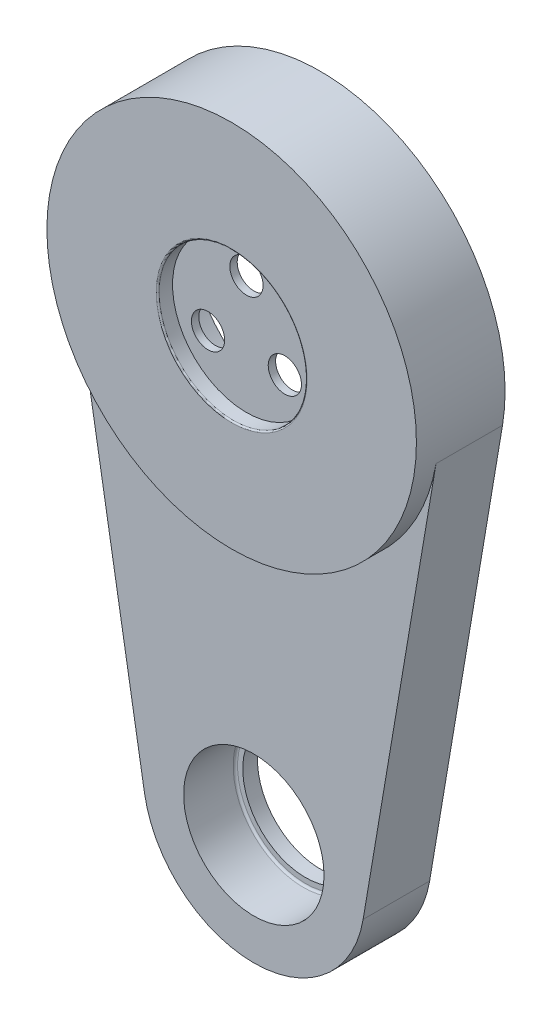
ISO-10303-21;
HEADER;
FILE_DESCRIPTION(('STEP AP214'),'2;1');
FILE_NAME('part.step','',(''),(''),'','','');
FILE_SCHEMA(('AUTOMOTIVE_DESIGN { 1 0 10303 214 1 1 1 1 }'));
ENDSEC;
DATA;
#1=APPLICATION_CONTEXT('core data for automotive mechanical design processes');
#2=APPLICATION_PROTOCOL_DEFINITION('international standard','automotive_design',2000,#1);
#3=PRODUCT_CONTEXT('',#1,'mechanical');
#4=PRODUCT('Part','Part','',(#3));
#5=PRODUCT_RELATED_PRODUCT_CATEGORY('part','',(#4));
#6=PRODUCT_DEFINITION_FORMATION('','',#4);
#7=PRODUCT_DEFINITION_CONTEXT('part definition',#1,'design');
#8=PRODUCT_DEFINITION('design','',#6,#7);
#9=PRODUCT_DEFINITION_SHAPE('','',#8);
#10=(LENGTH_UNIT() NAMED_UNIT(*) SI_UNIT(.MILLI.,.METRE.));
#11=(NAMED_UNIT(*) PLANE_ANGLE_UNIT() SI_UNIT($,.RADIAN.));
#12=(NAMED_UNIT(*) SI_UNIT($,.STERADIAN.) SOLID_ANGLE_UNIT());
#13=UNCERTAINTY_MEASURE_WITH_UNIT(LENGTH_MEASURE(1.E-05),#10,'distance_accuracy_value','');
#14=(GEOMETRIC_REPRESENTATION_CONTEXT(3) GLOBAL_UNCERTAINTY_ASSIGNED_CONTEXT((#13)) GLOBAL_UNIT_ASSIGNED_CONTEXT((#10,
#11,#12)) REPRESENTATION_CONTEXT('',''));
#15=CARTESIAN_POINT('',(0.,0.,0.));
#16=DIRECTION('',(0.,0.,1.));
#17=DIRECTION('',(1.,0.,0.));
#18=AXIS2_PLACEMENT_3D('',#15,#16,#17);
#19=CARTESIAN_POINT('',(0.,0.,-4.));
#20=DIRECTION('',(0.,0.,-1.));
#21=DIRECTION('',(-1.,0.,0.));
#22=AXIS2_PLACEMENT_3D('',#19,#20,#21);
#23=PLANE('',#22);
#24=CARTESIAN_POINT('',(0.,6.,-4.));
#25=DIRECTION('',(0.,0.,-1.));
#26=DIRECTION('',(-1.,0.,0.));
#27=AXIS2_PLACEMENT_3D('',#24,#25,#26);
#28=CIRCLE('',#27,3.99999999999999);
#29=CARTESIAN_POINT('',(-3.99999999999999,6.,-4.));
#30=VERTEX_POINT('',#29);
#31=EDGE_CURVE('E137',#30,#30,#28,.T.);
#32=ORIENTED_EDGE('',*,*,#31,.F.);
#33=EDGE_LOOP('',(#32));
#34=FACE_BOUND('',#33,.T.);
#35=CARTESIAN_POINT('',(-5.19615242270662,-3.00000000000003,-4.));
#36=DIRECTION('',(0.,0.,-1.));
#37=DIRECTION('',(-1.,0.,0.));
#38=AXIS2_PLACEMENT_3D('',#35,#36,#37);
#39=CIRCLE('',#38,3.99999999999999);
#40=CARTESIAN_POINT('',(-9.19615242270661,-3.00000000000003,-4.));
#41=VERTEX_POINT('',#40);
#42=EDGE_CURVE('E127',#41,#41,#39,.T.);
#43=ORIENTED_EDGE('',*,*,#42,.F.);
#44=EDGE_LOOP('',(#43));
#45=FACE_BOUND('',#44,.T.);
#46=CARTESIAN_POINT('',(5.19615242270666,-2.99999999999995,-4.));
#47=DIRECTION('',(0.,0.,-1.));
#48=DIRECTION('',(-1.,0.,0.));
#49=AXIS2_PLACEMENT_3D('',#46,#47,#48);
#50=CIRCLE('',#49,3.99999999999999);
#51=CARTESIAN_POINT('',(1.19615242270667,-2.99999999999995,-4.));
#52=VERTEX_POINT('',#51);
#53=EDGE_CURVE('E117',#52,#52,#50,.T.);
#54=ORIENTED_EDGE('',*,*,#53,.F.);
#55=EDGE_LOOP('',(#54));
#56=FACE_BOUND('',#55,.T.);
#57=CARTESIAN_POINT('',(0.,0.,-4.));
#58=DIRECTION('',(0.,0.,-1.));
#59=DIRECTION('',(-1.,0.,0.));
#60=AXIS2_PLACEMENT_3D('',#57,#58,#59);
#61=CIRCLE('',#60,17.5);
#62=CARTESIAN_POINT('',(-17.5,0.,-4.));
#63=VERTEX_POINT('',#62);
#64=EDGE_CURVE('E164',#63,#63,#61,.F.);
#65=ORIENTED_EDGE('',*,*,#64,.F.);
#66=EDGE_LOOP('',(#65));
#67=FACE_BOUND('',#66,.T.);
#68=ADVANCED_FACE('F38',(#34,#45,#56,#67),#23,.T.);
#69=CARTESIAN_POINT('',(0.,0.,-2.));
#70=DIRECTION('',(0.,0.,1.));
#71=DIRECTION('',(1.,0.,0.));
#72=AXIS2_PLACEMENT_3D('',#69,#70,#71);
#73=CYLINDRICAL_SURFACE('',#72,25.);
#74=CARTESIAN_POINT('',(0.,0.,0.));
#75=DIRECTION('',(0.,0.,-1.));
#76=DIRECTION('',(-1.,0.,0.));
#77=AXIS2_PLACEMENT_3D('',#74,#75,#76);
#78=CIRCLE('',#77,25.);
#79=CARTESIAN_POINT('',(-25.,0.,0.));
#80=VERTEX_POINT('',#79);
#81=EDGE_CURVE('E155',#80,#80,#78,.T.);
#82=ORIENTED_EDGE('',*,*,#81,.T.);
#83=EDGE_LOOP('',(#82));
#84=FACE_BOUND('',#83,.T.);
#85=CARTESIAN_POINT('',(0.,0.,-12.));
#86=DIRECTION('',(0.,0.,-1.));
#87=DIRECTION('',(-1.,0.,0.));
#88=AXIS2_PLACEMENT_3D('',#85,#86,#87);
#89=CIRCLE('',#88,25.);
#90=CARTESIAN_POINT('',(-24.6503324295817,-4.16666666666667,-12.));
#91=VERTEX_POINT('',#90);
#92=CARTESIAN_POINT('',(24.6503324295817,-4.16666666666667,-12.));
#93=VERTEX_POINT('',#92);
#94=EDGE_CURVE('E150',#91,#93,#89,.T.);
#95=ORIENTED_EDGE('',*,*,#94,.F.);
#96=DIRECTION('',(0.,0.,-1.));
#97=VECTOR('',#96,1.);
#98=CARTESIAN_POINT('',(-24.6503324295817,-4.16666666666667,-3.));
#99=LINE('',#98,#97);
#100=CARTESIAN_POINT('',(-24.6503324295817,-4.16666666666667,-3.));
#101=VERTEX_POINT('',#100);
#102=EDGE_CURVE('E110',#101,#91,#99,.T.);
#103=ORIENTED_EDGE('',*,*,#102,.F.);
#104=CARTESIAN_POINT('',(0.,0.,-3.));
#105=DIRECTION('',(0.,0.,1.));
#106=DIRECTION('',(-1.,0.,0.));
#107=AXIS2_PLACEMENT_3D('',#104,#105,#106);
#108=CIRCLE('',#107,25.);
#109=CARTESIAN_POINT('',(24.6503324295817,-4.16666666666667,-3.));
#110=VERTEX_POINT('',#109);
#111=EDGE_CURVE('E62',#101,#110,#108,.T.);
#112=ORIENTED_EDGE('',*,*,#111,.T.);
#113=DIRECTION('',(0.,0.,-1.));
#114=VECTOR('',#113,1.);
#115=CARTESIAN_POINT('',(24.6503324295817,-4.16666666666667,-3.));
#116=LINE('',#115,#114);
#117=EDGE_CURVE('E86',#110,#93,#116,.T.);
#118=ORIENTED_EDGE('',*,*,#117,.T.);
#119=EDGE_LOOP('',(#95,#103,#112,#118));
#120=FACE_BOUND('',#119,.T.);
#121=ADVANCED_FACE('F194',(#84,#120),#73,.T.);
#122=CARTESIAN_POINT('',(0.,0.,0.));
#123=DIRECTION('',(0.,0.,-1.));
#124=DIRECTION('',(-1.,0.,0.));
#125=AXIS2_PLACEMENT_3D('',#122,#123,#124);
#126=PLANE('',#125);
#127=CARTESIAN_POINT('',(0.,0.,0.));
#128=DIRECTION('',(0.,0.,-1.));
#129=DIRECTION('',(-1.,0.,0.));
#130=AXIS2_PLACEMENT_3D('',#127,#128,#129);
#131=CIRCLE('',#130,10.2);
#132=CARTESIAN_POINT('',(-10.2,0.,0.));
#133=VERTEX_POINT('',#132);
#134=EDGE_CURVE('E161',#133,#133,#131,.T.);
#135=ORIENTED_EDGE('',*,*,#134,.T.);
#136=EDGE_LOOP('',(#135));
#137=FACE_BOUND('',#136,.T.);
#138=ORIENTED_EDGE('',*,*,#81,.F.);
#139=EDGE_LOOP('',(#138));
#140=FACE_BOUND('',#139,.T.);
#141=ADVANCED_FACE('F200',(#137,#140),#126,.F.);
#142=CARTESIAN_POINT('',(0.,0.,-2.));
#143=DIRECTION('',(0.,0.,1.));
#144=DIRECTION('',(1.,0.,0.));
#145=AXIS2_PLACEMENT_3D('',#142,#143,#144);
#146=CYLINDRICAL_SURFACE('',#145,10.);
#147=CARTESIAN_POINT('',(0.,0.,-0.2));
#148=DIRECTION('',(0.,0.,-1.));
#149=DIRECTION('',(-1.,0.,0.));
#150=AXIS2_PLACEMENT_3D('',#147,#148,#149);
#151=CIRCLE('',#150,10.);
#152=CARTESIAN_POINT('',(-10.,0.,-0.2));
#153=VERTEX_POINT('',#152);
#154=EDGE_CURVE('E158',#153,#153,#151,.F.);
#155=ORIENTED_EDGE('',*,*,#154,.T.);
#156=EDGE_LOOP('',(#155));
#157=FACE_BOUND('',#156,.T.);
#158=CARTESIAN_POINT('',(0.,0.,-2.));
#159=DIRECTION('',(0.,0.,1.));
#160=DIRECTION('',(1.,0.,0.));
#161=AXIS2_PLACEMENT_3D('',#158,#159,#160);
#162=CIRCLE('',#161,10.);
#163=CARTESIAN_POINT('',(10.,0.,-2.));
#164=VERTEX_POINT('',#163);
#165=EDGE_CURVE('E152',#164,#164,#162,.T.);
#166=ORIENTED_EDGE('',*,*,#165,.F.);
#167=EDGE_LOOP('',(#166));
#168=FACE_BOUND('',#167,.T.);
#169=ADVANCED_FACE('F222',(#157,#168),#146,.F.);
#170=CARTESIAN_POINT('',(0.,0.,-0.2));
#171=DIRECTION('',(0.,0.,-1.));
#172=DIRECTION('',(-1.,0.,0.));
#173=AXIS2_PLACEMENT_3D('',#170,#171,#172);
#174=TOROIDAL_SURFACE('',#173,10.2,0.2);
#175=ORIENTED_EDGE('',*,*,#134,.F.);
#176=EDGE_LOOP('',(#175));
#177=FACE_BOUND('',#176,.T.);
#178=ORIENTED_EDGE('',*,*,#154,.F.);
#179=EDGE_LOOP('',(#178));
#180=FACE_BOUND('',#179,.T.);
#181=ADVANCED_FACE('F220',(#177,#180),#174,.T.);
#182=CARTESIAN_POINT('',(0.,0.,-2.));
#183=DIRECTION('',(0.,0.,-1.));
#184=DIRECTION('',(-1.,0.,0.));
#185=AXIS2_PLACEMENT_3D('',#182,#183,#184);
#186=PLANE('',#185);
#187=CARTESIAN_POINT('',(5.19615242270666,-2.99999999999995,-2.));
#188=DIRECTION('',(0.,0.,-1.));
#189=DIRECTION('',(-1.,0.,0.));
#190=AXIS2_PLACEMENT_3D('',#187,#188,#189);
#191=CIRCLE('',#190,2.25);
#192=CARTESIAN_POINT('',(2.94615242270666,-2.99999999999995,-2.));
#193=VERTEX_POINT('',#192);
#194=EDGE_CURVE('E126',#193,#193,#191,.T.);
#195=ORIENTED_EDGE('',*,*,#194,.T.);
#196=EDGE_LOOP('',(#195));
#197=FACE_BOUND('',#196,.T.);
#198=CARTESIAN_POINT('',(-5.19615242270662,-3.00000000000003,-2.));
#199=DIRECTION('',(0.,0.,-1.));
#200=DIRECTION('',(-1.,0.,0.));
#201=AXIS2_PLACEMENT_3D('',#198,#199,#200);
#202=CIRCLE('',#201,2.25);
#203=CARTESIAN_POINT('',(-7.44615242270662,-3.00000000000003,-2.));
#204=VERTEX_POINT('',#203);
#205=EDGE_CURVE('E136',#204,#204,#202,.T.);
#206=ORIENTED_EDGE('',*,*,#205,.T.);
#207=EDGE_LOOP('',(#206));
#208=FACE_BOUND('',#207,.T.);
#209=CARTESIAN_POINT('',(0.,6.,-2.));
#210=DIRECTION('',(0.,0.,-1.));
#211=DIRECTION('',(-1.,0.,0.));
#212=AXIS2_PLACEMENT_3D('',#209,#210,#211);
#213=CIRCLE('',#212,2.25);
#214=CARTESIAN_POINT('',(-2.25,6.,-2.));
#215=VERTEX_POINT('',#214);
#216=EDGE_CURVE('E146',#215,#215,#213,.T.);
#217=ORIENTED_EDGE('',*,*,#216,.T.);
#218=EDGE_LOOP('',(#217));
#219=FACE_BOUND('',#218,.T.);
#220=ORIENTED_EDGE('',*,*,#165,.T.);
#221=EDGE_LOOP('',(#220));
#222=FACE_BOUND('',#221,.T.);
#223=ADVANCED_FACE('F216',(#197,#208,#219,#222),#186,.F.);
#224=CARTESIAN_POINT('',(0.,0.,-12.));
#225=DIRECTION('',(0.,0.,-1.));
#226=DIRECTION('',(-1.,0.,0.));
#227=AXIS2_PLACEMENT_3D('',#224,#225,#226);
#228=PLANE('',#227);
#229=CARTESIAN_POINT('',(0.,-60.,-12.));
#230=DIRECTION('',(0.,0.,1.));
#231=DIRECTION('',(1.,0.,0.));
#232=AXIS2_PLACEMENT_3D('',#229,#230,#231);
#233=CIRCLE('',#232,8.50000000000001);
#234=CARTESIAN_POINT('',(8.5,-60.,-12.));
#235=VERTEX_POINT('',#234);
#236=EDGE_CURVE('E523',#235,#235,#233,.T.);
#237=ORIENTED_EDGE('',*,*,#236,.T.);
#238=EDGE_LOOP('',(#237));
#239=FACE_BOUND('',#238,.T.);
#240=CARTESIAN_POINT('',(0.,0.,-12.));
#241=DIRECTION('',(0.,0.,-1.));
#242=DIRECTION('',(-1.,0.,0.));
#243=AXIS2_PLACEMENT_3D('',#240,#241,#242);
#244=CIRCLE('',#243,18.5);
#245=CARTESIAN_POINT('',(-18.5,0.,-12.));
#246=VERTEX_POINT('',#245);
#247=EDGE_CURVE('E147',#246,#246,#244,.T.);
#248=ORIENTED_EDGE('',*,*,#247,.F.);
#249=EDGE_LOOP('',(#248));
#250=FACE_BOUND('',#249,.T.);
#251=ORIENTED_EDGE('',*,*,#94,.T.);
#252=DIRECTION('',(-0.166666666666667,-0.986013297183269,0.));
#253=VECTOR('',#252,1.);
#254=CARTESIAN_POINT('',(24.6503324295817,-4.16666666666667,-12.));
#255=LINE('',#254,#253);
#256=CARTESIAN_POINT('',(14.790199457749,-62.5,-12.));
#257=VERTEX_POINT('',#256);
#258=EDGE_CURVE('E105',#93,#257,#255,.T.);
#259=ORIENTED_EDGE('',*,*,#258,.T.);
#260=CARTESIAN_POINT('',(0.,-60.,-12.));
#261=DIRECTION('',(0.,0.,-1.));
#262=DIRECTION('',(-1.,0.,0.));
#263=AXIS2_PLACEMENT_3D('',#260,#261,#262);
#264=CIRCLE('',#263,15.);
#265=CARTESIAN_POINT('',(-14.790199457749,-62.5,-12.));
#266=VERTEX_POINT('',#265);
#267=EDGE_CURVE('E92',#257,#266,#264,.T.);
#268=ORIENTED_EDGE('',*,*,#267,.T.);
#269=DIRECTION('',(-0.166666666666667,0.986013297183269,0.));
#270=VECTOR('',#269,1.);
#271=CARTESIAN_POINT('',(-24.6503324295817,-4.16666666666667,-12.));
#272=LINE('',#271,#270);
#273=EDGE_CURVE('E53',#266,#91,#272,.T.);
#274=ORIENTED_EDGE('',*,*,#273,.T.);
#275=EDGE_LOOP('',(#251,#259,#268,#274));
#276=FACE_BOUND('',#275,.T.);
#277=ADVANCED_FACE('F212',(#239,#250,#276),#228,.T.);
#278=CARTESIAN_POINT('',(0.,0.,-4.));
#279=DIRECTION('',(0.,0.,-1.));
#280=DIRECTION('',(-1.,0.,0.));
#281=AXIS2_PLACEMENT_3D('',#278,#279,#280);
#282=CYLINDRICAL_SURFACE('',#281,18.5);
#283=CARTESIAN_POINT('',(0.,0.,-5.3));
#284=DIRECTION('',(0.,0.,-1.));
#285=DIRECTION('',(-1.,0.,0.));
#286=AXIS2_PLACEMENT_3D('',#283,#284,#285);
#287=CIRCLE('',#286,18.5);
#288=CARTESIAN_POINT('',(-18.5,0.,-5.3));
#289=VERTEX_POINT('',#288);
#290=EDGE_CURVE('E176',#289,#289,#287,.F.);
#291=ORIENTED_EDGE('',*,*,#290,.T.);
#292=EDGE_LOOP('',(#291));
#293=FACE_BOUND('',#292,.T.);
#294=ORIENTED_EDGE('',*,*,#247,.T.);
#295=EDGE_LOOP('',(#294));
#296=FACE_BOUND('',#295,.T.);
#297=ADVANCED_FACE('F209',(#293,#296),#282,.F.);
#298=CARTESIAN_POINT('',(0.,6.,-4.));
#299=DIRECTION('',(0.,0.,-1.));
#300=DIRECTION('',(-1.,0.,0.));
#301=AXIS2_PLACEMENT_3D('',#298,#299,#300);
#302=CYLINDRICAL_SURFACE('',#301,2.25);
#303=CARTESIAN_POINT('',(0.,6.,-3.));
#304=DIRECTION('',(0.,0.,-1.));
#305=DIRECTION('',(-1.,0.,0.));
#306=AXIS2_PLACEMENT_3D('',#303,#304,#305);
#307=CIRCLE('',#306,2.25);
#308=CARTESIAN_POINT('',(-2.25,6.,-3.));
#309=VERTEX_POINT('',#308);
#310=EDGE_CURVE('E143',#309,#309,#307,.T.);
#311=ORIENTED_EDGE('',*,*,#310,.T.);
#312=EDGE_LOOP('',(#311));
#313=FACE_BOUND('',#312,.T.);
#314=ORIENTED_EDGE('',*,*,#216,.F.);
#315=EDGE_LOOP('',(#314));
#316=FACE_BOUND('',#315,.T.);
#317=ADVANCED_FACE('F207',(#313,#316),#302,.F.);
#318=CARTESIAN_POINT('',(2.25,6.,-3.));
#319=DIRECTION('',(0.,0.,1.));
#320=DIRECTION('',(1.,0.,0.));
#321=AXIS2_PLACEMENT_3D('',#318,#319,#320);
#322=PLANE('',#321);
#323=ORIENTED_EDGE('',*,*,#310,.F.);
#324=EDGE_LOOP('',(#323));
#325=FACE_BOUND('',#324,.T.);
#326=CARTESIAN_POINT('',(0.,6.,-3.));
#327=DIRECTION('',(0.,0.,-1.));
#328=DIRECTION('',(-1.,0.,0.));
#329=AXIS2_PLACEMENT_3D('',#326,#327,#328);
#330=CIRCLE('',#329,4.);
#331=CARTESIAN_POINT('',(-4.,6.,-3.));
#332=VERTEX_POINT('',#331);
#333=EDGE_CURVE('E140',#332,#332,#330,.T.);
#334=ORIENTED_EDGE('',*,*,#333,.T.);
#335=EDGE_LOOP('',(#334));
#336=FACE_BOUND('',#335,.T.);
#337=ADVANCED_FACE('F294',(#325,#336),#322,.F.);
#338=CARTESIAN_POINT('',(0.,6.,-4.));
#339=DIRECTION('',(0.,0.,-1.));
#340=DIRECTION('',(-1.,0.,0.));
#341=AXIS2_PLACEMENT_3D('',#338,#339,#340);
#342=CYLINDRICAL_SURFACE('',#341,4.);
#343=ORIENTED_EDGE('',*,*,#333,.F.);
#344=EDGE_LOOP('',(#343));
#345=FACE_BOUND('',#344,.T.);
#346=ORIENTED_EDGE('',*,*,#31,.T.);
#347=EDGE_LOOP('',(#346));
#348=FACE_BOUND('',#347,.T.);
#349=ADVANCED_FACE('F291',(#345,#348),#342,.F.);
#350=CARTESIAN_POINT('',(-5.19615242270662,-3.00000000000003,-4.));
#351=DIRECTION('',(0.,0.,-1.));
#352=DIRECTION('',(-1.,0.,0.));
#353=AXIS2_PLACEMENT_3D('',#350,#351,#352);
#354=CYLINDRICAL_SURFACE('',#353,2.25);
#355=CARTESIAN_POINT('',(-5.19615242270662,-3.00000000000003,-3.));
#356=DIRECTION('',(0.,0.,-1.));
#357=DIRECTION('',(-1.,0.,0.));
#358=AXIS2_PLACEMENT_3D('',#355,#356,#357);
#359=CIRCLE('',#358,2.25);
#360=CARTESIAN_POINT('',(-7.44615242270662,-3.00000000000003,-3.));
#361=VERTEX_POINT('',#360);
#362=EDGE_CURVE('E133',#361,#361,#359,.T.);
#363=ORIENTED_EDGE('',*,*,#362,.T.);
#364=EDGE_LOOP('',(#363));
#365=FACE_BOUND('',#364,.T.);
#366=ORIENTED_EDGE('',*,*,#205,.F.);
#367=EDGE_LOOP('',(#366));
#368=FACE_BOUND('',#367,.T.);
#369=ADVANCED_FACE('F287',(#365,#368),#354,.F.);
#370=CARTESIAN_POINT('',(-2.94615242270662,-3.00000000000003,-3.));
#371=DIRECTION('',(0.,0.,1.));
#372=DIRECTION('',(1.,0.,0.));
#373=AXIS2_PLACEMENT_3D('',#370,#371,#372);
#374=PLANE('',#373);
#375=ORIENTED_EDGE('',*,*,#362,.F.);
#376=EDGE_LOOP('',(#375));
#377=FACE_BOUND('',#376,.T.);
#378=CARTESIAN_POINT('',(-5.19615242270662,-3.00000000000003,-3.));
#379=DIRECTION('',(0.,0.,-1.));
#380=DIRECTION('',(-1.,0.,0.));
#381=AXIS2_PLACEMENT_3D('',#378,#379,#380);
#382=CIRCLE('',#381,4.);
#383=CARTESIAN_POINT('',(-9.19615242270662,-3.00000000000003,-3.));
#384=VERTEX_POINT('',#383);
#385=EDGE_CURVE('E130',#384,#384,#382,.T.);
#386=ORIENTED_EDGE('',*,*,#385,.T.);
#387=EDGE_LOOP('',(#386));
#388=FACE_BOUND('',#387,.T.);
#389=ADVANCED_FACE('F283',(#377,#388),#374,.F.);
#390=CARTESIAN_POINT('',(-5.19615242270662,-3.00000000000003,-4.));
#391=DIRECTION('',(0.,0.,-1.));
#392=DIRECTION('',(-1.,0.,0.));
#393=AXIS2_PLACEMENT_3D('',#390,#391,#392);
#394=CYLINDRICAL_SURFACE('',#393,4.);
#395=ORIENTED_EDGE('',*,*,#385,.F.);
#396=EDGE_LOOP('',(#395));
#397=FACE_BOUND('',#396,.T.);
#398=ORIENTED_EDGE('',*,*,#42,.T.);
#399=EDGE_LOOP('',(#398));
#400=FACE_BOUND('',#399,.T.);
#401=ADVANCED_FACE('F279',(#397,#400),#394,.F.);
#402=CARTESIAN_POINT('',(5.19615242270666,-2.99999999999995,-4.));
#403=DIRECTION('',(0.,0.,-1.));
#404=DIRECTION('',(-1.,0.,0.));
#405=AXIS2_PLACEMENT_3D('',#402,#403,#404);
#406=CYLINDRICAL_SURFACE('',#405,2.25);
#407=CARTESIAN_POINT('',(5.19615242270666,-2.99999999999995,-3.));
#408=DIRECTION('',(0.,0.,-1.));
#409=DIRECTION('',(-1.,0.,0.));
#410=AXIS2_PLACEMENT_3D('',#407,#408,#409);
#411=CIRCLE('',#410,2.25);
#412=CARTESIAN_POINT('',(2.94615242270666,-2.99999999999995,-3.));
#413=VERTEX_POINT('',#412);
#414=EDGE_CURVE('E123',#413,#413,#411,.T.);
#415=ORIENTED_EDGE('',*,*,#414,.T.);
#416=EDGE_LOOP('',(#415));
#417=FACE_BOUND('',#416,.T.);
#418=ORIENTED_EDGE('',*,*,#194,.F.);
#419=EDGE_LOOP('',(#418));
#420=FACE_BOUND('',#419,.T.);
#421=ADVANCED_FACE('F275',(#417,#420),#406,.F.);
#422=CARTESIAN_POINT('',(7.44615242270666,-2.99999999999995,-3.));
#423=DIRECTION('',(0.,0.,1.));
#424=DIRECTION('',(1.,0.,0.));
#425=AXIS2_PLACEMENT_3D('',#422,#423,#424);
#426=PLANE('',#425);
#427=ORIENTED_EDGE('',*,*,#414,.F.);
#428=EDGE_LOOP('',(#427));
#429=FACE_BOUND('',#428,.T.);
#430=CARTESIAN_POINT('',(5.19615242270666,-2.99999999999995,-3.));
#431=DIRECTION('',(0.,0.,-1.));
#432=DIRECTION('',(-1.,0.,0.));
#433=AXIS2_PLACEMENT_3D('',#430,#431,#432);
#434=CIRCLE('',#433,4.);
#435=CARTESIAN_POINT('',(1.19615242270666,-2.99999999999995,-3.));
#436=VERTEX_POINT('',#435);
#437=EDGE_CURVE('E120',#436,#436,#434,.T.);
#438=ORIENTED_EDGE('',*,*,#437,.T.);
#439=EDGE_LOOP('',(#438));
#440=FACE_BOUND('',#439,.T.);
#441=ADVANCED_FACE('F271',(#429,#440),#426,.F.);
#442=CARTESIAN_POINT('',(5.19615242270666,-2.99999999999995,-4.));
#443=DIRECTION('',(0.,0.,-1.));
#444=DIRECTION('',(-1.,0.,0.));
#445=AXIS2_PLACEMENT_3D('',#442,#443,#444);
#446=CYLINDRICAL_SURFACE('',#445,4.);
#447=ORIENTED_EDGE('',*,*,#437,.F.);
#448=EDGE_LOOP('',(#447));
#449=FACE_BOUND('',#448,.T.);
#450=ORIENTED_EDGE('',*,*,#53,.T.);
#451=EDGE_LOOP('',(#450));
#452=FACE_BOUND('',#451,.T.);
#453=ADVANCED_FACE('F251',(#449,#452),#446,.F.);
#454=CARTESIAN_POINT('',(0.,0.,-5.));
#455=DIRECTION('',(0.,0.,-1.));
#456=DIRECTION('',(-1.,0.,0.));
#457=AXIS2_PLACEMENT_3D('',#454,#455,#456);
#458=PLANE('',#457);
#459=CARTESIAN_POINT('',(0.,0.,-5.));
#460=DIRECTION('',(0.,0.,-1.));
#461=DIRECTION('',(-1.,0.,0.));
#462=AXIS2_PLACEMENT_3D('',#459,#460,#461);
#463=CIRCLE('',#462,18.2);
#464=CARTESIAN_POINT('',(-18.2,0.,-5.));
#465=VERTEX_POINT('',#464);
#466=EDGE_CURVE('E173',#465,#465,#463,.T.);
#467=ORIENTED_EDGE('',*,*,#466,.T.);
#468=EDGE_LOOP('',(#467));
#469=FACE_BOUND('',#468,.T.);
#470=CARTESIAN_POINT('',(0.,0.,-5.));
#471=DIRECTION('',(0.,0.,-1.));
#472=DIRECTION('',(-1.,0.,0.));
#473=AXIS2_PLACEMENT_3D('',#470,#471,#472);
#474=CIRCLE('',#473,17.5);
#475=CARTESIAN_POINT('',(-17.5,0.,-5.));
#476=VERTEX_POINT('',#475);
#477=EDGE_CURVE('E112',#476,#476,#474,.T.);
#478=ORIENTED_EDGE('',*,*,#477,.F.);
#479=EDGE_LOOP('',(#478));
#480=FACE_BOUND('',#479,.T.);
#481=ADVANCED_FACE('F247',(#469,#480),#458,.T.);
#482=CARTESIAN_POINT('',(0.,0.,-5.));
#483=DIRECTION('',(0.,0.,1.));
#484=DIRECTION('',(1.,0.,0.));
#485=AXIS2_PLACEMENT_3D('',#482,#483,#484);
#486=CYLINDRICAL_SURFACE('',#485,17.5);
#487=ORIENTED_EDGE('',*,*,#477,.T.);
#488=EDGE_LOOP('',(#487));
#489=FACE_BOUND('',#488,.T.);
#490=ORIENTED_EDGE('',*,*,#64,.T.);
#491=EDGE_LOOP('',(#490));
#492=FACE_BOUND('',#491,.T.);
#493=ADVANCED_FACE('F250',(#489,#492),#486,.F.);
#494=CARTESIAN_POINT('',(-24.6503324295817,-4.16666666666667,-3.));
#495=DIRECTION('',(-0.986013297183269,-0.166666666666667,0.));
#496=DIRECTION('',(0.166666666666667,-0.986013297183269,0.));
#497=AXIS2_PLACEMENT_3D('',#494,#495,#496);
#498=PLANE('',#497);
#499=ORIENTED_EDGE('',*,*,#273,.F.);
#500=DIRECTION('',(0.,0.,-1.));
#501=VECTOR('',#500,1.);
#502=CARTESIAN_POINT('',(-14.790199457749,-62.5,-3.));
#503=LINE('',#502,#501);
#504=CARTESIAN_POINT('',(-14.790199457749,-62.5,-3.));
#505=VERTEX_POINT('',#504);
#506=EDGE_CURVE('E80',#505,#266,#503,.T.);
#507=ORIENTED_EDGE('',*,*,#506,.F.);
#508=DIRECTION('',(-0.166666666666667,0.986013297183269,0.));
#509=VECTOR('',#508,1.);
#510=CARTESIAN_POINT('',(-24.6503324295817,-4.16666666666667,-3.));
#511=LINE('',#510,#509);
#512=EDGE_CURVE('E97',#505,#101,#511,.T.);
#513=ORIENTED_EDGE('',*,*,#512,.T.);
#514=ORIENTED_EDGE('',*,*,#102,.T.);
#515=EDGE_LOOP('',(#499,#507,#513,#514));
#516=FACE_BOUND('',#515,.T.);
#517=ADVANCED_FACE('F257',(#516),#498,.T.);
#518=CARTESIAN_POINT('',(0.,-60.,-3.));
#519=DIRECTION('',(0.,0.,-1.));
#520=DIRECTION('',(-1.,0.,0.));
#521=AXIS2_PLACEMENT_3D('',#518,#519,#520);
#522=CYLINDRICAL_SURFACE('',#521,15.);
#523=ORIENTED_EDGE('',*,*,#267,.F.);
#524=DIRECTION('',(0.,0.,-1.));
#525=VECTOR('',#524,1.);
#526=CARTESIAN_POINT('',(14.790199457749,-62.5,-3.));
#527=LINE('',#526,#525);
#528=CARTESIAN_POINT('',(14.790199457749,-62.5,-3.));
#529=VERTEX_POINT('',#528);
#530=EDGE_CURVE('E88',#529,#257,#527,.T.);
#531=ORIENTED_EDGE('',*,*,#530,.F.);
#532=CARTESIAN_POINT('',(0.,-60.,-3.));
#533=DIRECTION('',(0.,0.,-1.));
#534=DIRECTION('',(-1.,0.,0.));
#535=AXIS2_PLACEMENT_3D('',#532,#533,#534);
#536=CIRCLE('',#535,15.);
#537=EDGE_CURVE('E91',#529,#505,#536,.T.);
#538=ORIENTED_EDGE('',*,*,#537,.T.);
#539=ORIENTED_EDGE('',*,*,#506,.T.);
#540=EDGE_LOOP('',(#523,#531,#538,#539));
#541=FACE_BOUND('',#540,.T.);
#542=ADVANCED_FACE('F90',(#541),#522,.T.);
#543=CARTESIAN_POINT('',(24.6503324295817,-4.16666666666667,-3.));
#544=DIRECTION('',(0.986013297183269,-0.166666666666667,0.));
#545=DIRECTION('',(0.166666666666667,0.986013297183269,0.));
#546=AXIS2_PLACEMENT_3D('',#543,#544,#545);
#547=PLANE('',#546);
#548=ORIENTED_EDGE('',*,*,#258,.F.);
#549=ORIENTED_EDGE('',*,*,#117,.F.);
#550=DIRECTION('',(-0.166666666666667,-0.986013297183269,0.));
#551=VECTOR('',#550,1.);
#552=CARTESIAN_POINT('',(24.6503324295817,-4.16666666666667,-3.));
#553=LINE('',#552,#551);
#554=EDGE_CURVE('E96',#110,#529,#553,.T.);
#555=ORIENTED_EDGE('',*,*,#554,.T.);
#556=ORIENTED_EDGE('',*,*,#530,.T.);
#557=EDGE_LOOP('',(#548,#549,#555,#556));
#558=FACE_BOUND('',#557,.T.);
#559=ADVANCED_FACE('F99',(#558),#547,.T.);
#560=CARTESIAN_POINT('',(0.,0.,-3.));
#561=DIRECTION('',(0.,0.,-1.));
#562=DIRECTION('',(-1.,0.,0.));
#563=AXIS2_PLACEMENT_3D('',#560,#561,#562);
#564=PLANE('',#563);
#565=CARTESIAN_POINT('',(0.,-60.,-3.));
#566=DIRECTION('',(0.,0.,1.));
#567=DIRECTION('',(1.,0.,0.));
#568=AXIS2_PLACEMENT_3D('',#565,#566,#567);
#569=CIRCLE('',#568,9.5);
#570=CARTESIAN_POINT('',(9.49999999999999,-60.,-3.));
#571=VERTEX_POINT('',#570);
#572=EDGE_CURVE('E107',#571,#571,#569,.T.);
#573=ORIENTED_EDGE('',*,*,#572,.F.);
#574=EDGE_LOOP('',(#573));
#575=FACE_BOUND('',#574,.T.);
#576=ORIENTED_EDGE('',*,*,#111,.F.);
#577=ORIENTED_EDGE('',*,*,#512,.F.);
#578=ORIENTED_EDGE('',*,*,#537,.F.);
#579=ORIENTED_EDGE('',*,*,#554,.F.);
#580=EDGE_LOOP('',(#576,#577,#578,#579));
#581=FACE_BOUND('',#580,.T.);
#582=ADVANCED_FACE('F95',(#575,#581),#564,.F.);
#583=CARTESIAN_POINT('',(0.,0.,-5.3));
#584=DIRECTION('',(0.,0.,-1.));
#585=DIRECTION('',(-1.,0.,0.));
#586=AXIS2_PLACEMENT_3D('',#583,#584,#585);
#587=TOROIDAL_SURFACE('',#586,18.2,0.3);
#588=ORIENTED_EDGE('',*,*,#290,.F.);
#589=EDGE_LOOP('',(#588));
#590=FACE_BOUND('',#589,.T.);
#591=ORIENTED_EDGE('',*,*,#466,.F.);
#592=EDGE_LOOP('',(#591));
#593=FACE_BOUND('',#592,.T.);
#594=ADVANCED_FACE('F231',(#590,#593),#587,.F.);
#595=CARTESIAN_POINT('',(0.,-60.,-10.));
#596=DIRECTION('',(0.,0.,1.));
#597=DIRECTION('',(1.,0.,0.));
#598=AXIS2_PLACEMENT_3D('',#595,#596,#597);
#599=CYLINDRICAL_SURFACE('',#598,9.5);
#600=CARTESIAN_POINT('',(0.,-60.,-9.7));
#601=DIRECTION('',(0.,0.,1.));
#602=DIRECTION('',(1.,0.,0.));
#603=AXIS2_PLACEMENT_3D('',#600,#601,#602);
#604=CIRCLE('',#603,9.5);
#605=CARTESIAN_POINT('',(9.49999999999999,-60.,-9.7));
#606=VERTEX_POINT('',#605);
#607=EDGE_CURVE('E11',#606,#606,#604,.F.);
#608=ORIENTED_EDGE('',*,*,#607,.T.);
#609=EDGE_LOOP('',(#608));
#610=FACE_BOUND('',#609,.T.);
#611=ORIENTED_EDGE('',*,*,#572,.T.);
#612=EDGE_LOOP('',(#611));
#613=FACE_BOUND('',#612,.T.);
#614=ADVANCED_FACE('F233',(#610,#613),#599,.F.);
#615=CARTESIAN_POINT('',(0.,-60.,-10.));
#616=DIRECTION('',(0.,0.,1.));
#617=DIRECTION('',(1.,0.,0.));
#618=AXIS2_PLACEMENT_3D('',#615,#616,#617);
#619=PLANE('',#618);
#620=CARTESIAN_POINT('',(0.,-60.,-10.));
#621=DIRECTION('',(0.,0.,1.));
#622=DIRECTION('',(1.,0.,0.));
#623=AXIS2_PLACEMENT_3D('',#620,#621,#622);
#624=CIRCLE('',#623,9.2);
#625=CARTESIAN_POINT('',(9.19999999999999,-60.,-10.));
#626=VERTEX_POINT('',#625);
#627=EDGE_CURVE('E46',#626,#626,#624,.T.);
#628=ORIENTED_EDGE('',*,*,#627,.T.);
#629=EDGE_LOOP('',(#628));
#630=FACE_BOUND('',#629,.T.);
#631=CARTESIAN_POINT('',(0.,-60.,-10.));
#632=DIRECTION('',(0.,0.,1.));
#633=DIRECTION('',(1.,0.,0.));
#634=AXIS2_PLACEMENT_3D('',#631,#632,#633);
#635=CIRCLE('',#634,8.50000000000001);
#636=CARTESIAN_POINT('',(8.5,-60.,-10.));
#637=VERTEX_POINT('',#636);
#638=EDGE_CURVE('E525',#637,#637,#635,.T.);
#639=ORIENTED_EDGE('',*,*,#638,.F.);
#640=EDGE_LOOP('',(#639));
#641=FACE_BOUND('',#640,.T.);
#642=ADVANCED_FACE('F181',(#630,#641),#619,.T.);
#643=CARTESIAN_POINT('',(0.,-60.,-12.));
#644=DIRECTION('',(0.,0.,1.));
#645=DIRECTION('',(1.,0.,0.));
#646=AXIS2_PLACEMENT_3D('',#643,#644,#645);
#647=CYLINDRICAL_SURFACE('',#646,8.50000000000001);
#648=ORIENTED_EDGE('',*,*,#236,.F.);
#649=EDGE_LOOP('',(#648));
#650=FACE_BOUND('',#649,.T.);
#651=ORIENTED_EDGE('',*,*,#638,.T.);
#652=EDGE_LOOP('',(#651));
#653=FACE_BOUND('',#652,.T.);
#654=ADVANCED_FACE('F185',(#650,#653),#647,.F.);
#655=CARTESIAN_POINT('',(0.,-60.,-9.7));
#656=DIRECTION('',(0.,0.,1.));
#657=DIRECTION('',(1.,0.,0.));
#658=AXIS2_PLACEMENT_3D('',#655,#656,#657);
#659=TOROIDAL_SURFACE('',#658,9.2,0.3);
#660=ORIENTED_EDGE('',*,*,#607,.F.);
#661=EDGE_LOOP('',(#660));
#662=FACE_BOUND('',#661,.T.);
#663=ORIENTED_EDGE('',*,*,#627,.F.);
#664=EDGE_LOOP('',(#663));
#665=FACE_BOUND('',#664,.T.);
#666=ADVANCED_FACE('F40',(#662,#665),#659,.F.);
#667=CLOSED_SHELL('',(#68,#121,#141,#169,#181,#223,#277,#297,#317,#337,#349,#369,#389,#401,#421,
#441,#453,#481,#493,#517,#542,#559,#582,#594,#614,#642,#654,#666));
#668=MANIFOLD_SOLID_BREP('B2',#667);
#669=ADVANCED_BREP_SHAPE_REPRESENTATION('',(#18,#668),#14);
#670=SHAPE_DEFINITION_REPRESENTATION(#9,#669);
ENDSEC;
END-ISO-10303-21;
